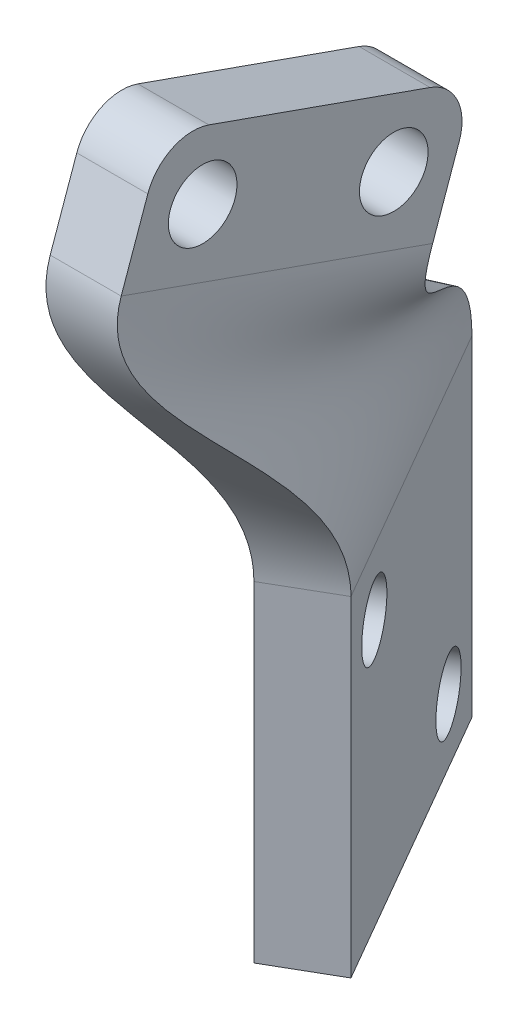
ISO-10303-21;
HEADER;
FILE_DESCRIPTION(('STEP AP214'),'2;1');
FILE_NAME('part.step','',(''),(''),'','','');
FILE_SCHEMA(('AUTOMOTIVE_DESIGN { 1 0 10303 214 1 1 1 1 }'));
ENDSEC;
DATA;
#1=APPLICATION_CONTEXT('core data for automotive mechanical design processes');
#2=APPLICATION_PROTOCOL_DEFINITION('international standard','automotive_design',2000,#1);
#3=PRODUCT_CONTEXT('',#1,'mechanical');
#4=PRODUCT('Part','Part','',(#3));
#5=PRODUCT_RELATED_PRODUCT_CATEGORY('part','',(#4));
#6=PRODUCT_DEFINITION_FORMATION('','',#4);
#7=PRODUCT_DEFINITION_CONTEXT('part definition',#1,'design');
#8=PRODUCT_DEFINITION('design','',#6,#7);
#9=PRODUCT_DEFINITION_SHAPE('','',#8);
#10=(LENGTH_UNIT() NAMED_UNIT(*) SI_UNIT(.MILLI.,.METRE.));
#11=(NAMED_UNIT(*) PLANE_ANGLE_UNIT() SI_UNIT($,.RADIAN.));
#12=(NAMED_UNIT(*) SI_UNIT($,.STERADIAN.) SOLID_ANGLE_UNIT());
#13=UNCERTAINTY_MEASURE_WITH_UNIT(LENGTH_MEASURE(1.E-05),#10,'distance_accuracy_value','');
#14=(GEOMETRIC_REPRESENTATION_CONTEXT(3) GLOBAL_UNCERTAINTY_ASSIGNED_CONTEXT((#13)) GLOBAL_UNIT_ASSIGNED_CONTEXT((#10,
#11,#12)) REPRESENTATION_CONTEXT('',''));
#15=CARTESIAN_POINT('',(0.,0.,0.));
#16=DIRECTION('',(0.,0.,1.));
#17=DIRECTION('',(1.,0.,0.));
#18=AXIS2_PLACEMENT_3D('',#15,#16,#17);
#19=CARTESIAN_POINT('',(36.0126016447818,0.,-20.7918852538335));
#20=DIRECTION('',(0.866025403784439,0.,-0.5));
#21=DIRECTION('',(-0.5,0.,-0.866025403784439));
#22=AXIS2_PLACEMENT_3D('',#19,#20,#21);
#23=PLANE('',#22);
#24=CARTESIAN_POINT('',(-20.7011353903661,15.4443912705977,-119.02295928581));
#25=DIRECTION('',(0.866025403784438,0.,-0.5));
#26=DIRECTION('',(-0.5,0.,-0.866025403784438));
#27=AXIS2_PLACEMENT_3D('',#24,#25,#26);
#28=CIRCLE('',#27,2.15000000000001);
#29=CARTESIAN_POINT('',(-21.7761353903661,15.4443912705977,-120.884913903947));
#30=VERTEX_POINT('',#29);
#31=EDGE_CURVE('E427',#30,#30,#28,.T.);
#32=ORIENTED_EDGE('',*,*,#31,.F.);
#33=EDGE_LOOP('',(#32));
#34=FACE_BOUND('',#33,.T.);
#35=DIRECTION('',(0.,-1.,0.));
#36=VECTOR('',#35,1.);
#37=CARTESIAN_POINT('',(-18.7011353903661,19.4443912705977,-115.558857670673));
#38=LINE('',#37,#36);
#39=CARTESIAN_POINT('',(-18.7011353903661,19.4443912705977,-115.558857670673));
#40=VERTEX_POINT('',#39);
#41=CARTESIAN_POINT('',(-18.7011353903661,-1.25560872940228,-115.558857670673));
#42=VERTEX_POINT('',#41);
#43=EDGE_CURVE('E421',#40,#42,#38,.T.);
#44=ORIENTED_EDGE('',*,*,#43,.T.);
#45=DIRECTION('',(-0.5,0.,-0.866025403784439));
#46=VECTOR('',#45,1.);
#47=CARTESIAN_POINT('',(-18.7011353903661,-1.25560872940228,-115.558857670673));
#48=LINE('',#47,#46);
#49=CARTESIAN_POINT('',(-29.0511353903661,-1.25560872940228,-133.485583529011));
#50=VERTEX_POINT('',#49);
#51=EDGE_CURVE('E430',#42,#50,#48,.T.);
#52=ORIENTED_EDGE('',*,*,#51,.T.);
#53=DIRECTION('',(0.,1.,0.));
#54=VECTOR('',#53,1.);
#55=CARTESIAN_POINT('',(-29.0511353903661,19.4443912705977,-133.485583529011));
#56=LINE('',#55,#54);
#57=CARTESIAN_POINT('',(-29.0511353903661,19.4443912705977,-133.485583529011));
#58=VERTEX_POINT('',#57);
#59=EDGE_CURVE('E414',#50,#58,#56,.T.);
#60=ORIENTED_EDGE('',*,*,#59,.T.);
#61=DIRECTION('',(-0.5,0.,-0.866025403784439));
#62=VECTOR('',#61,1.);
#63=CARTESIAN_POINT('',(36.0126016447818,19.4443912705977,-20.7918852538335));
#64=LINE('',#63,#62);
#65=EDGE_CURVE('E412',#58,#40,#64,.F.);
#66=ORIENTED_EDGE('',*,*,#65,.T.);
#67=EDGE_LOOP('',(#44,#52,#60,#66));
#68=FACE_BOUND('',#67,.T.);
#69=CARTESIAN_POINT('',(-27.0511353903661,2.74439127059772,-130.021481913873));
#70=DIRECTION('',(0.866025403784438,0.,-0.5));
#71=DIRECTION('',(-0.5,0.,-0.866025403784438));
#72=AXIS2_PLACEMENT_3D('',#69,#70,#71);
#73=CIRCLE('',#72,2.15000000000001);
#74=CARTESIAN_POINT('',(-28.1261353903661,2.74439127059772,-131.883436532009));
#75=VERTEX_POINT('',#74);
#76=EDGE_CURVE('E445',#75,#75,#73,.T.);
#77=ORIENTED_EDGE('',*,*,#76,.F.);
#78=EDGE_LOOP('',(#77));
#79=FACE_BOUND('',#78,.T.);
#80=ADVANCED_FACE('F279',(#34,#68,#79),#23,.T.);
#81=CARTESIAN_POINT('',(32.158788597941,0.,-18.5668852538335));
#82=DIRECTION('',(0.866025403784439,0.,-0.5));
#83=DIRECTION('',(-0.5,0.,-0.866025403784439));
#84=AXIS2_PLACEMENT_3D('',#81,#82,#83);
#85=PLANE('',#84);
#86=DIRECTION('',(0.,-1.,0.));
#87=VECTOR('',#86,1.);
#88=CARTESIAN_POINT('',(-22.5549484372068,19.4443912705977,-113.333857670673));
#89=LINE('',#88,#87);
#90=CARTESIAN_POINT('',(-22.5549484372068,19.4443912705977,-113.333857670673));
#91=VERTEX_POINT('',#90);
#92=CARTESIAN_POINT('',(-22.5549484372068,-1.25560872940228,-113.333857670673));
#93=VERTEX_POINT('',#92);
#94=EDGE_CURVE('E423',#91,#93,#89,.T.);
#95=ORIENTED_EDGE('',*,*,#94,.F.);
#96=DIRECTION('',(-0.5,0.,-0.866025403784439));
#97=VECTOR('',#96,1.);
#98=CARTESIAN_POINT('',(32.1587885979411,19.4443912705977,-18.5668852538335));
#99=LINE('',#98,#97);
#100=CARTESIAN_POINT('',(-32.9049484372068,19.4443912705977,-131.260583529011));
#101=VERTEX_POINT('',#100);
#102=EDGE_CURVE('E418',#101,#91,#99,.F.);
#103=ORIENTED_EDGE('',*,*,#102,.F.);
#104=DIRECTION('',(0.,1.,0.));
#105=VECTOR('',#104,1.);
#106=CARTESIAN_POINT('',(-32.9049484372068,19.4443912705977,-131.260583529011));
#107=LINE('',#106,#105);
#108=CARTESIAN_POINT('',(-32.9049484372068,-1.25560872940228,-131.260583529011));
#109=VERTEX_POINT('',#108);
#110=EDGE_CURVE('E422',#109,#101,#107,.T.);
#111=ORIENTED_EDGE('',*,*,#110,.F.);
#112=DIRECTION('',(-0.5,0.,-0.866025403784439));
#113=VECTOR('',#112,1.);
#114=CARTESIAN_POINT('',(-22.5549484372068,-1.25560872940228,-113.333857670673));
#115=LINE('',#114,#113);
#116=EDGE_CURVE('E426',#93,#109,#115,.T.);
#117=ORIENTED_EDGE('',*,*,#116,.F.);
#118=EDGE_LOOP('',(#95,#103,#111,#117));
#119=FACE_BOUND('',#118,.T.);
#120=CARTESIAN_POINT('',(-24.5549484372068,15.4443912705977,-116.79795928581));
#121=DIRECTION('',(0.866025403784438,0.,-0.5));
#122=DIRECTION('',(-0.5,0.,-0.866025403784438));
#123=AXIS2_PLACEMENT_3D('',#120,#121,#122);
#124=CIRCLE('',#123,2.15000000000001);
#125=CARTESIAN_POINT('',(-25.6299484372068,15.4443912705977,-118.659913903947));
#126=VERTEX_POINT('',#125);
#127=EDGE_CURVE('E442',#126,#126,#124,.T.);
#128=ORIENTED_EDGE('',*,*,#127,.T.);
#129=EDGE_LOOP('',(#128));
#130=FACE_BOUND('',#129,.T.);
#131=CARTESIAN_POINT('',(-30.9049484372068,2.74439127059772,-127.796481913873));
#132=DIRECTION('',(0.866025403784438,0.,-0.5));
#133=DIRECTION('',(-0.5,0.,-0.866025403784438));
#134=AXIS2_PLACEMENT_3D('',#131,#132,#133);
#135=CIRCLE('',#134,2.15000000000001);
#136=CARTESIAN_POINT('',(-31.9799484372068,2.74439127059772,-129.658436532009));
#137=VERTEX_POINT('',#136);
#138=EDGE_CURVE('E448',#137,#137,#135,.T.);
#139=ORIENTED_EDGE('',*,*,#138,.T.);
#140=EDGE_LOOP('',(#139));
#141=FACE_BOUND('',#140,.T.);
#142=ADVANCED_FACE('F583',(#119,#130,#141),#85,.F.);
#143=CARTESIAN_POINT('',(-18.7011353903661,19.4443912705977,-115.558857670673));
#144=DIRECTION('',(-0.500000000000001,0.,-0.866025403784438));
#145=DIRECTION('',(-0.866025403784438,0.,0.500000000000001));
#146=AXIS2_PLACEMENT_3D('',#143,#144,#145);
#147=PLANE('',#146);
#148=ORIENTED_EDGE('',*,*,#94,.T.);
#149=DIRECTION('',(-0.866025403784438,0.,0.500000000000001));
#150=VECTOR('',#149,1.);
#151=CARTESIAN_POINT('',(-18.7011353903661,-1.25560872940228,-115.558857670673));
#152=LINE('',#151,#150);
#153=EDGE_CURVE('E434',#42,#93,#152,.T.);
#154=ORIENTED_EDGE('',*,*,#153,.F.);
#155=ORIENTED_EDGE('',*,*,#43,.F.);
#156=DIRECTION('',(-0.866025403784438,0.,0.500000000000001));
#157=VECTOR('',#156,1.);
#158=CARTESIAN_POINT('',(-18.7011353903661,19.4443912705977,-115.558857670673));
#159=LINE('',#158,#157);
#160=EDGE_CURVE('E367',#40,#91,#159,.T.);
#161=ORIENTED_EDGE('',*,*,#160,.T.);
#162=EDGE_LOOP('',(#148,#154,#155,#161));
#163=FACE_BOUND('',#162,.T.);
#164=ADVANCED_FACE('F635',(#163),#147,.F.);
#165=CARTESIAN_POINT('',(-18.7011353903661,-1.25560872940228,-115.558857670673));
#166=DIRECTION('',(0.,1.,0.));
#167=DIRECTION('',(-1.,0.,0.));
#168=AXIS2_PLACEMENT_3D('',#165,#166,#167);
#169=PLANE('',#168);
#170=ORIENTED_EDGE('',*,*,#116,.T.);
#171=DIRECTION('',(-0.866025403784438,0.,0.500000000000001));
#172=VECTOR('',#171,1.);
#173=CARTESIAN_POINT('',(-29.0511353903661,-1.25560872940228,-133.485583529011));
#174=LINE('',#173,#172);
#175=EDGE_CURVE('E417',#50,#109,#174,.T.);
#176=ORIENTED_EDGE('',*,*,#175,.F.);
#177=ORIENTED_EDGE('',*,*,#51,.F.);
#178=ORIENTED_EDGE('',*,*,#153,.T.);
#179=EDGE_LOOP('',(#170,#176,#177,#178));
#180=FACE_BOUND('',#179,.T.);
#181=ADVANCED_FACE('F644',(#180),#169,.F.);
#182=CARTESIAN_POINT('',(-29.0511353903661,19.4443912705977,-133.485583529011));
#183=DIRECTION('',(0.500000000000001,0.,0.866025403784438));
#184=DIRECTION('',(0.866025403784438,0.,-0.500000000000001));
#185=AXIS2_PLACEMENT_3D('',#182,#183,#184);
#186=PLANE('',#185);
#187=ORIENTED_EDGE('',*,*,#110,.T.);
#188=DIRECTION('',(0.866025403784438,0.,-0.500000000000001));
#189=VECTOR('',#188,1.);
#190=CARTESIAN_POINT('',(-29.0511353903661,19.4443912705977,-133.485583529011));
#191=LINE('',#190,#189);
#192=EDGE_CURVE('E411',#58,#101,#191,.F.);
#193=ORIENTED_EDGE('',*,*,#192,.F.);
#194=ORIENTED_EDGE('',*,*,#59,.F.);
#195=ORIENTED_EDGE('',*,*,#175,.T.);
#196=EDGE_LOOP('',(#187,#193,#194,#195));
#197=FACE_BOUND('',#196,.T.);
#198=ADVANCED_FACE('F579',(#197),#186,.F.);
#199=CARTESIAN_POINT('',(-20.7011353903661,15.4443912705977,-119.02295928581));
#200=DIRECTION('',(-0.866025403784438,0.,0.500000000000001));
#201=DIRECTION('',(0.500000000000001,0.,0.866025403784438));
#202=AXIS2_PLACEMENT_3D('',#199,#200,#201);
#203=CYLINDRICAL_SURFACE('',#202,2.15000000000001);
#204=ORIENTED_EDGE('',*,*,#31,.T.);
#205=EDGE_LOOP('',(#204));
#206=FACE_BOUND('',#205,.T.);
#207=ORIENTED_EDGE('',*,*,#127,.F.);
#208=EDGE_LOOP('',(#207));
#209=FACE_BOUND('',#208,.T.);
#210=ADVANCED_FACE('F575',(#206,#209),#203,.F.);
#211=CARTESIAN_POINT('',(-27.0511353903661,2.74439127059772,-130.021481913873));
#212=DIRECTION('',(-0.866025403784438,0.,0.500000000000001));
#213=DIRECTION('',(0.500000000000001,0.,0.866025403784438));
#214=AXIS2_PLACEMENT_3D('',#211,#212,#213);
#215=CYLINDRICAL_SURFACE('',#214,2.15000000000001);
#216=ORIENTED_EDGE('',*,*,#76,.T.);
#217=EDGE_LOOP('',(#216));
#218=FACE_BOUND('',#217,.T.);
#219=ORIENTED_EDGE('',*,*,#138,.F.);
#220=EDGE_LOOP('',(#219));
#221=FACE_BOUND('',#220,.T.);
#222=ADVANCED_FACE('F567',(#218,#221),#215,.F.);
#223=CARTESIAN_POINT('',(-19.9264999621046,34.817114234562,-121.906255403122));
#224=CARTESIAN_POINT('',(-19.9264999621046,29.4641305199487,-120.013689861029));
#225=CARTESIAN_POINT('',(-29.0511353903661,25.7539488037761,-133.485583529011));
#226=CARTESIAN_POINT('',(-29.0511353903661,19.4443912705977,-133.485583529011));
#227=CARTESIAN_POINT('',(-19.9264999621046,35.967114234562,-118.653564209663));
#228=CARTESIAN_POINT('',(-19.9264999621046,30.4132485934664,-116.689976181355));
#229=CARTESIAN_POINT('',(-27.3261353903661,25.987559033846,-130.497795885954));
#230=CARTESIAN_POINT('',(-27.3261353903661,19.4443912705977,-130.497795885954));
#231=CARTESIAN_POINT('',(-19.9264999621046,38.267114234562,-112.148181822747));
#232=CARTESIAN_POINT('',(-19.9264999621046,32.311484740502,-110.042548822005));
#233=CARTESIAN_POINT('',(-23.8761353903661,26.4547794939856,-124.522220599842));
#234=CARTESIAN_POINT('',(-23.8761353903661,19.4443912705977,-124.522220599842));
#235=CARTESIAN_POINT('',(-19.9264999621046,40.567114234562,-105.642799435831));
#236=CARTESIAN_POINT('',(-19.9264999621046,33.9336796904833,-103.297526161493));
#237=CARTESIAN_POINT('',(-20.4261353903661,27.2147858576111,-118.546645313729));
#238=CARTESIAN_POINT('',(-20.4261353903661,19.4443912705977,-118.546645313729));
#239=CARTESIAN_POINT('',(-19.9264999621046,41.717114234562,-102.390108242373));
#240=CARTESIAN_POINT('',(-19.9264999621046,34.744777165474,-99.9250148312376));
#241=CARTESIAN_POINT('',(-18.7011353903661,27.5947890394238,-115.558857670673));
#242=CARTESIAN_POINT('',(-18.7011353903661,19.4443912705977,-115.558857670673));
#243=B_SPLINE_SURFACE_WITH_KNOTS('',3,3,((#223,#224,#225,#226),(#227,#228,#229,#230),(#231,#232,
#233,#234),(#235,#236,#237,#238),(#239,#240,#241,#242)),.UNSPECIFIED.,.F.,.F.,.F.,(4,1,4),(4,4),
(0.,0.5,1.),(0.,1.),.UNSPECIFIED.);
#244=DIRECTION('',(0.,0.333333333333334,0.942809041582063));
#245=VECTOR('',#244,1.);
#246=CARTESIAN_POINT('',(-19.9264999621046,41.717114234562,-102.390108242373));
#247=LINE('',#246,#245);
#248=CARTESIAN_POINT('',(-19.9264999621046,34.817114234562,-121.906255403122));
#249=VERTEX_POINT('',#248);
#250=CARTESIAN_POINT('',(-19.9264999621046,41.717114234562,-102.390108242373));
#251=VERTEX_POINT('',#250);
#252=EDGE_CURVE('E375',#249,#251,#247,.T.);
#253=CARTESIAN_POINT('',(-19.9264999621046,41.717114234562,-102.390108242373));
#254=CARTESIAN_POINT('',(-19.9264999621046,34.744777165474,-99.9250148312376));
#255=CARTESIAN_POINT('',(-18.7011353903661,27.5947890394238,-115.558857670673));
#256=CARTESIAN_POINT('',(-18.7011353903661,19.4443912705977,-115.558857670673));
#257=B_SPLINE_CURVE_WITH_KNOTS('',3,(#253,#254,#255,#256),.UNSPECIFIED.,.F.,.F.,(4,4),(0.,1.),.UNSPECIFIED.);
#258=EDGE_CURVE('E359',#251,#40,#257,.T.);
#259=CARTESIAN_POINT('',(-19.9264999621046,34.817114234562,-121.906255403122));
#260=CARTESIAN_POINT('',(-19.9264999621046,29.4641305199487,-120.013689861029));
#261=CARTESIAN_POINT('',(-29.0511353903661,25.7539488037761,-133.485583529011));
#262=CARTESIAN_POINT('',(-29.0511353903661,19.4443912705977,-133.485583529011));
#263=B_SPLINE_CURVE_WITH_KNOTS('',3,(#259,#260,#261,#262),.UNSPECIFIED.,.F.,.F.,(4,4),(0.,1.),.UNSPECIFIED.);
#264=EDGE_CURVE('E371',#58,#249,#263,.F.);
#265=ORIENTED_EDGE('',*,*,#252,.T.);
#266=ORIENTED_EDGE('',*,*,#258,.T.);
#267=ORIENTED_EDGE('',*,*,#65,.F.);
#268=ORIENTED_EDGE('',*,*,#264,.T.);
#269=EDGE_LOOP('',(#265,#266,#267,#268));
#270=FACE_BOUND('',#269,.T.);
#271=ADVANCED_FACE('F377',(#270),#243,.T.);
#272=CARTESIAN_POINT('',(-19.9264999621046,41.717114234562,-102.390108242373));
#273=CARTESIAN_POINT('',(-19.9264999621046,34.744777165474,-99.9250148312376));
#274=CARTESIAN_POINT('',(-18.7011353903661,27.5947890394238,-115.558857670673));
#275=CARTESIAN_POINT('',(-18.7011353903661,19.4443912705977,-115.558857670673));
#276=CARTESIAN_POINT('',(-20.6681666287712,41.717114234562,-102.390108242373));
#277=CARTESIAN_POINT('',(-20.6681666287712,34.7632933196294,-99.93156128032));
#278=CARTESIAN_POINT('',(-19.3434375648395,27.5586682106952,-115.188024337339));
#279=CARTESIAN_POINT('',(-19.3434375648395,19.4443912705977,-115.188024337339));
#280=CARTESIAN_POINT('',(-22.1514999621046,41.717114234562,-102.390108242373));
#281=CARTESIAN_POINT('',(-22.1514999621046,34.8003256279401,-99.9446541784847));
#282=CARTESIAN_POINT('',(-20.6280419137864,27.486426553238,-114.446357670673));
#283=CARTESIAN_POINT('',(-20.6280419137865,19.4443912705977,-114.446357670673));
#284=CARTESIAN_POINT('',(-23.6348332954379,41.717114234562,-102.390108242373));
#285=CARTESIAN_POINT('',(-23.6348332954379,34.8294381564157,-99.954947011636));
#286=CARTESIAN_POINT('',(-21.9126462627334,27.4225850908212,-113.704691004006));
#287=CARTESIAN_POINT('',(-21.9126462627334,19.4443912705977,-113.704691004006));
#288=CARTESIAN_POINT('',(-24.3764999621046,41.717114234562,-102.390108242373));
#289=CARTESIAN_POINT('',(-24.3764999621046,34.8439944206534,-99.9600934282116));
#290=CARTESIAN_POINT('',(-22.5549484372068,27.3906643596128,-113.333857670673));
#291=CARTESIAN_POINT('',(-22.5549484372068,19.4443912705977,-113.333857670673));
#292=B_SPLINE_SURFACE_WITH_KNOTS('',3,3,((#272,#273,#274,#275),(#276,#277,#278,#279),(#280,#281,
#282,#283),(#284,#285,#286,#287),(#288,#289,#290,#291)),.UNSPECIFIED.,.F.,.F.,.F.,(4,1,4),(4,4),
(0.,0.5,1.),(0.,1.),.UNSPECIFIED.);
#293=DIRECTION('',(1.,0.,0.));
#294=VECTOR('',#293,1.);
#295=CARTESIAN_POINT('',(-24.3764999621046,41.717114234562,-102.390108242373));
#296=LINE('',#295,#294);
#297=CARTESIAN_POINT('',(-24.3764999621046,41.717114234562,-102.390108242373));
#298=VERTEX_POINT('',#297);
#299=EDGE_CURVE('E364',#298,#251,#296,.T.);
#300=CARTESIAN_POINT('',(-24.3764999621046,41.717114234562,-102.390108242373));
#301=CARTESIAN_POINT('',(-24.3764999621046,34.8439944206534,-99.9600934282116));
#302=CARTESIAN_POINT('',(-22.5549484372068,27.3906643596128,-113.333857670673));
#303=CARTESIAN_POINT('',(-22.5549484372068,19.4443912705977,-113.333857670673));
#304=B_SPLINE_CURVE_WITH_KNOTS('',3,(#300,#301,#302,#303),.UNSPECIFIED.,.F.,.F.,(4,4),(0.,1.),.UNSPECIFIED.);
#305=EDGE_CURVE('E370',#298,#91,#304,.T.);
#306=ORIENTED_EDGE('',*,*,#299,.F.);
#307=ORIENTED_EDGE('',*,*,#305,.T.);
#308=ORIENTED_EDGE('',*,*,#160,.F.);
#309=ORIENTED_EDGE('',*,*,#258,.F.);
#310=EDGE_LOOP('',(#306,#307,#308,#309));
#311=FACE_BOUND('',#310,.T.);
#312=ADVANCED_FACE('F361',(#311),#292,.T.);
#313=CARTESIAN_POINT('',(-24.3764999621046,34.817114234562,-121.906255403122));
#314=CARTESIAN_POINT('',(-24.3764999621046,29.6321550476523,-120.073095502502));
#315=CARTESIAN_POINT('',(-32.9049484372068,25.4768429904699,-131.260583529011));
#316=CARTESIAN_POINT('',(-32.9049484372068,19.4443912705977,-131.260583529011));
#317=CARTESIAN_POINT('',(-23.6348332954379,34.817114234562,-121.906255403122));
#318=CARTESIAN_POINT('',(-23.6348332954379,29.606088630895,-120.063879632477));
#319=CARTESIAN_POINT('',(-32.2626462627334,25.5209720820269,-131.631416862344));
#320=CARTESIAN_POINT('',(-32.2626462627334,19.4443912705977,-131.631416862344));
#321=CARTESIAN_POINT('',(-22.1514999621046,34.817114234562,-121.906255403122));
#322=CARTESIAN_POINT('',(-22.1514999621046,29.5539557973803,-120.045447892426));
#323=CARTESIAN_POINT('',(-30.9780419137865,25.6092302651409,-132.373083529011));
#324=CARTESIAN_POINT('',(-30.9780419137865,19.4443912705977,-132.373083529011));
#325=CARTESIAN_POINT('',(-20.6681666287713,34.817114234562,-121.906255403122));
#326=CARTESIAN_POINT('',(-20.6681666287713,29.4940722790926,-120.024275871495));
#327=CARTESIAN_POINT('',(-29.6934375648396,25.7057092908977,-133.114750195677));
#328=CARTESIAN_POINT('',(-29.6934375648396,19.4443912705977,-133.114750195677));
#329=CARTESIAN_POINT('',(-19.9264999621046,34.817114234562,-121.906255403122));
#330=CARTESIAN_POINT('',(-19.9264999621046,29.4641305199487,-120.013689861029));
#331=CARTESIAN_POINT('',(-29.0511353903661,25.7539488037761,-133.485583529011));
#332=CARTESIAN_POINT('',(-29.0511353903661,19.4443912705977,-133.485583529011));
#333=B_SPLINE_SURFACE_WITH_KNOTS('',3,3,((#313,#314,#315,#316),(#317,#318,#319,#320),(#321,#322,
#323,#324),(#325,#326,#327,#328),(#329,#330,#331,#332)),.UNSPECIFIED.,.F.,.F.,.F.,(4,1,4),(4,4),
(0.,0.5,1.),(0.,1.),.UNSPECIFIED.);
#334=DIRECTION('',(1.,0.,0.));
#335=VECTOR('',#334,1.);
#336=CARTESIAN_POINT('',(-24.3764999621046,34.817114234562,-121.906255403122));
#337=LINE('',#336,#335);
#338=CARTESIAN_POINT('',(-24.3764999621046,34.817114234562,-121.906255403122));
#339=VERTEX_POINT('',#338);
#340=EDGE_CURVE('E512',#339,#249,#337,.T.);
#341=CARTESIAN_POINT('',(-24.3764999621046,34.817114234562,-121.906255403122));
#342=CARTESIAN_POINT('',(-24.3764999621046,29.6321550476523,-120.073095502502));
#343=CARTESIAN_POINT('',(-32.9049484372068,25.4768429904699,-131.260583529011));
#344=CARTESIAN_POINT('',(-32.9049484372068,19.4443912705977,-131.260583529011));
#345=B_SPLINE_CURVE_WITH_KNOTS('',3,(#341,#342,#343,#344),.UNSPECIFIED.,.F.,.F.,(4,4),(0.,1.),.UNSPECIFIED.);
#346=EDGE_CURVE('E451',#339,#101,#345,.T.);
#347=ORIENTED_EDGE('',*,*,#340,.T.);
#348=ORIENTED_EDGE('',*,*,#264,.F.);
#349=ORIENTED_EDGE('',*,*,#192,.T.);
#350=ORIENTED_EDGE('',*,*,#346,.F.);
#351=EDGE_LOOP('',(#347,#348,#349,#350));
#352=FACE_BOUND('',#351,.T.);
#353=ADVANCED_FACE('F533',(#352),#333,.T.);
#354=CARTESIAN_POINT('',(-24.3764999621046,41.717114234562,-102.390108242373));
#355=CARTESIAN_POINT('',(-24.3764999621046,34.8439944206534,-99.9600934282116));
#356=CARTESIAN_POINT('',(-22.5549484372068,27.3906643596128,-113.333857670673));
#357=CARTESIAN_POINT('',(-22.5549484372068,19.4443912705977,-113.333857670673));
#358=CARTESIAN_POINT('',(-24.3764999621046,40.567114234562,-105.642799435831));
#359=CARTESIAN_POINT('',(-24.3764999621046,34.0462975382929,-103.337342583428));
#360=CARTESIAN_POINT('',(-24.2799484372068,26.996447702919,-116.321645313729));
#361=CARTESIAN_POINT('',(-24.2799484372068,19.4443912705977,-116.321645313729));
#362=CARTESIAN_POINT('',(-24.3764999621046,38.267114234562,-112.148181822747));
#363=CARTESIAN_POINT('',(-24.3764999621046,32.4509037735719,-110.09184089386));
#364=CARTESIAN_POINT('',(-27.7299484372068,26.2080143895314,-122.297220599842));
#365=CARTESIAN_POINT('',(-27.7299484372068,19.4443912705977,-122.297220599842));
#366=CARTESIAN_POINT('',(-24.3764999621046,35.967114234562,-118.653564209663));
#367=CARTESIAN_POINT('',(-24.3764999621046,30.5717379562922,-116.746010632955));
#368=CARTESIAN_POINT('',(-31.1799484372068,25.7205667901571,-128.272795885954));
#369=CARTESIAN_POINT('',(-31.1799484372068,19.4443912705977,-128.272795885954));
#370=CARTESIAN_POINT('',(-24.3764999621046,34.817114234562,-121.906255403122));
#371=CARTESIAN_POINT('',(-24.3764999621046,29.6321550476523,-120.073095502502));
#372=CARTESIAN_POINT('',(-32.9049484372068,25.4768429904699,-131.260583529011));
#373=CARTESIAN_POINT('',(-32.9049484372068,19.4443912705977,-131.260583529011));
#374=B_SPLINE_SURFACE_WITH_KNOTS('',3,3,((#354,#355,#356,#357),(#358,#359,#360,#361),(#362,#363,
#364,#365),(#366,#367,#368,#369),(#370,#371,#372,#373)),.UNSPECIFIED.,.F.,.F.,.F.,(4,1,4),(4,4),
(0.,0.5,1.),(0.,1.),.UNSPECIFIED.);
#375=DIRECTION('',(0.,0.333333333333334,0.942809041582063));
#376=VECTOR('',#375,1.);
#377=CARTESIAN_POINT('',(-24.3764999621046,41.717114234562,-102.390108242373));
#378=LINE('',#377,#376);
#379=EDGE_CURVE('E392',#339,#298,#378,.T.);
#380=ORIENTED_EDGE('',*,*,#379,.F.);
#381=ORIENTED_EDGE('',*,*,#346,.T.);
#382=ORIENTED_EDGE('',*,*,#102,.T.);
#383=ORIENTED_EDGE('',*,*,#305,.F.);
#384=EDGE_LOOP('',(#380,#381,#382,#383));
#385=FACE_BOUND('',#384,.T.);
#386=ADVANCED_FACE('F483',(#385),#374,.T.);
#387=CARTESIAN_POINT('',(-24.3764999621045,0.,0.));
#388=DIRECTION('',(1.,0.,0.));
#389=DIRECTION('',(0.,0.,-1.));
#390=AXIS2_PLACEMENT_3D('',#387,#388,#389);
#391=PLANE('',#390);
#392=DIRECTION('',(0.,0.942809041582063,-0.333333333333335));
#393=VECTOR('',#392,1.);
#394=CARTESIAN_POINT('',(-24.3764999621046,49.2595865672185,-105.05677490904));
#395=LINE('',#394,#393);
#396=CARTESIAN_POINT('',(-24.3764999621046,46.4311594424723,-104.05677490904));
#397=VERTEX_POINT('',#396);
#398=EDGE_CURVE('E391',#298,#397,#395,.T.);
#399=ORIENTED_EDGE('',*,*,#398,.T.);
#400=CARTESIAN_POINT('',(-24.3764999621046,45.4311594424723,-106.885202033786));
#401=DIRECTION('',(1.,0.,0.));
#402=DIRECTION('',(0.,0.,-1.));
#403=AXIS2_PLACEMENT_3D('',#400,#401,#402);
#404=CIRCLE('',#403,3.);
#405=CARTESIAN_POINT('',(-24.3764999621046,48.2595865672185,-107.885202033786));
#406=VERTEX_POINT('',#405);
#407=EDGE_CURVE('E287',#397,#406,#404,.F.);
#408=ORIENTED_EDGE('',*,*,#407,.T.);
#409=DIRECTION('',(0.,-0.333333333333334,-0.942809041582063));
#410=VECTOR('',#409,1.);
#411=CARTESIAN_POINT('',(-24.3764999621046,42.3595865672185,-124.572922069788));
#412=LINE('',#411,#410);
#413=CARTESIAN_POINT('',(-24.3764999621046,43.3595865672185,-121.744494945042));
#414=VERTEX_POINT('',#413);
#415=EDGE_CURVE('E384',#406,#414,#412,.T.);
#416=ORIENTED_EDGE('',*,*,#415,.T.);
#417=CARTESIAN_POINT('',(-24.3764999621046,40.5311594424723,-120.744494945042));
#418=DIRECTION('',(1.,0.,0.));
#419=DIRECTION('',(0.,0.,-1.));
#420=AXIS2_PLACEMENT_3D('',#417,#418,#419);
#421=CIRCLE('',#420,3.);
#422=CARTESIAN_POINT('',(-24.3764999621046,39.5311594424723,-123.572922069788));
#423=VERTEX_POINT('',#422);
#424=EDGE_CURVE('E294',#414,#423,#421,.F.);
#425=ORIENTED_EDGE('',*,*,#424,.T.);
#426=DIRECTION('',(0.,-0.942809041582063,0.333333333333334));
#427=VECTOR('',#426,1.);
#428=CARTESIAN_POINT('',(-24.3764999621046,34.817114234562,-121.906255403122));
#429=LINE('',#428,#427);
#430=EDGE_CURVE('E404',#423,#339,#429,.T.);
#431=ORIENTED_EDGE('',*,*,#430,.T.);
#432=ORIENTED_EDGE('',*,*,#379,.T.);
#433=EDGE_LOOP('',(#399,#408,#416,#425,#431,#432));
#434=FACE_BOUND('',#433,.T.);
#435=CARTESIAN_POINT('',(-24.3764999621046,44.1550170675569,-107.494677742034));
#436=DIRECTION('',(-1.,0.,0.));
#437=DIRECTION('',(0.,0.,1.));
#438=AXIS2_PLACEMENT_3D('',#435,#436,#437);
#439=CIRCLE('',#438,2.15);
#440=CARTESIAN_POINT('',(-24.3764999621046,44.1550170675569,-105.344677742034));
#441=VERTEX_POINT('',#440);
#442=EDGE_CURVE('E406',#441,#441,#439,.T.);
#443=ORIENTED_EDGE('',*,*,#442,.F.);
#444=EDGE_LOOP('',(#443));
#445=FACE_BOUND('',#444,.T.);
#446=CARTESIAN_POINT('',(-24.3764999621046,39.9216837342236,-119.468352570127));
#447=DIRECTION('',(-1.,0.,0.));
#448=DIRECTION('',(0.,0.,1.));
#449=AXIS2_PLACEMENT_3D('',#446,#447,#448);
#450=CIRCLE('',#449,2.15);
#451=CARTESIAN_POINT('',(-24.3764999621046,39.9216837342236,-117.318352570127));
#452=VERTEX_POINT('',#451);
#453=EDGE_CURVE('E849',#452,#452,#450,.T.);
#454=ORIENTED_EDGE('',*,*,#453,.F.);
#455=EDGE_LOOP('',(#454));
#456=FACE_BOUND('',#455,.T.);
#457=ADVANCED_FACE('F473',(#434,#445,#456),#391,.F.);
#458=CARTESIAN_POINT('',(-19.9264999621045,0.,0.));
#459=DIRECTION('',(1.,0.,0.));
#460=DIRECTION('',(0.,0.,-1.));
#461=AXIS2_PLACEMENT_3D('',#458,#459,#460);
#462=PLANE('',#461);
#463=CARTESIAN_POINT('',(-19.9264999621046,44.1550170675569,-107.494677742034));
#464=DIRECTION('',(-1.,0.,0.));
#465=DIRECTION('',(0.,0.,1.));
#466=AXIS2_PLACEMENT_3D('',#463,#464,#465);
#467=CIRCLE('',#466,2.15);
#468=CARTESIAN_POINT('',(-19.9264999621046,44.1550170675569,-105.344677742034));
#469=VERTEX_POINT('',#468);
#470=EDGE_CURVE('E851',#469,#469,#467,.T.);
#471=ORIENTED_EDGE('',*,*,#470,.T.);
#472=EDGE_LOOP('',(#471));
#473=FACE_BOUND('',#472,.T.);
#474=DIRECTION('',(0.,-0.333333333333334,-0.942809041582063));
#475=VECTOR('',#474,1.);
#476=CARTESIAN_POINT('',(-19.9264999621046,42.3595865672185,-124.572922069788));
#477=LINE('',#476,#475);
#478=CARTESIAN_POINT('',(-19.9264999621046,48.2595865672185,-107.885202033786));
#479=VERTEX_POINT('',#478);
#480=CARTESIAN_POINT('',(-19.9264999621046,43.3595865672185,-121.744494945042));
#481=VERTEX_POINT('',#480);
#482=EDGE_CURVE('E400',#479,#481,#477,.T.);
#483=ORIENTED_EDGE('',*,*,#482,.F.);
#484=CARTESIAN_POINT('',(-19.9264999621046,45.4311594424723,-106.885202033786));
#485=DIRECTION('',(1.,0.,0.));
#486=DIRECTION('',(0.,0.,-1.));
#487=AXIS2_PLACEMENT_3D('',#484,#485,#486);
#488=CIRCLE('',#487,3.);
#489=CARTESIAN_POINT('',(-19.9264999621046,46.4311594424723,-104.05677490904));
#490=VERTEX_POINT('',#489);
#491=EDGE_CURVE('E399',#479,#490,#488,.T.);
#492=ORIENTED_EDGE('',*,*,#491,.T.);
#493=DIRECTION('',(0.,0.942809041582063,-0.333333333333335));
#494=VECTOR('',#493,1.);
#495=CARTESIAN_POINT('',(-19.9264999621046,49.2595865672185,-105.05677490904));
#496=LINE('',#495,#494);
#497=EDGE_CURVE('E390',#251,#490,#496,.T.);
#498=ORIENTED_EDGE('',*,*,#497,.F.);
#499=ORIENTED_EDGE('',*,*,#252,.F.);
#500=DIRECTION('',(0.,-0.942809041582063,0.333333333333334));
#501=VECTOR('',#500,1.);
#502=CARTESIAN_POINT('',(-19.9264999621046,34.817114234562,-121.906255403122));
#503=LINE('',#502,#501);
#504=CARTESIAN_POINT('',(-19.9264999621046,39.5311594424723,-123.572922069788));
#505=VERTEX_POINT('',#504);
#506=EDGE_CURVE('E401',#505,#249,#503,.T.);
#507=ORIENTED_EDGE('',*,*,#506,.F.);
#508=CARTESIAN_POINT('',(-19.9264999621046,40.5311594424723,-120.744494945042));
#509=DIRECTION('',(1.,0.,0.));
#510=DIRECTION('',(0.,0.,-1.));
#511=AXIS2_PLACEMENT_3D('',#508,#509,#510);
#512=CIRCLE('',#511,3.);
#513=EDGE_CURVE('E521',#505,#481,#512,.T.);
#514=ORIENTED_EDGE('',*,*,#513,.T.);
#515=EDGE_LOOP('',(#483,#492,#498,#499,#507,#514));
#516=FACE_BOUND('',#515,.T.);
#517=CARTESIAN_POINT('',(-19.9264999621046,39.9216837342236,-119.468352570127));
#518=DIRECTION('',(-1.,0.,0.));
#519=DIRECTION('',(0.,0.,1.));
#520=AXIS2_PLACEMENT_3D('',#517,#518,#519);
#521=CIRCLE('',#520,2.15);
#522=CARTESIAN_POINT('',(-19.9264999621046,39.9216837342236,-117.318352570127));
#523=VERTEX_POINT('',#522);
#524=EDGE_CURVE('E852',#523,#523,#521,.T.);
#525=ORIENTED_EDGE('',*,*,#524,.T.);
#526=EDGE_LOOP('',(#525));
#527=FACE_BOUND('',#526,.T.);
#528=ADVANCED_FACE('F397',(#473,#516,#527),#462,.T.);
#529=CARTESIAN_POINT('',(-24.3764999621046,34.817114234562,-121.906255403122));
#530=DIRECTION('',(0.,0.333333333333334,0.942809041582063));
#531=DIRECTION('',(0.,-0.942809041582063,0.333333333333334));
#532=AXIS2_PLACEMENT_3D('',#529,#530,#531);
#533=PLANE('',#532);
#534=ORIENTED_EDGE('',*,*,#430,.F.);
#535=DIRECTION('',(1.,0.,0.));
#536=VECTOR('',#535,1.);
#537=CARTESIAN_POINT('',(-24.3764999621046,39.5311594424723,-123.572922069788));
#538=LINE('',#537,#536);
#539=EDGE_CURVE('E13',#423,#505,#538,.T.);
#540=ORIENTED_EDGE('',*,*,#539,.T.);
#541=ORIENTED_EDGE('',*,*,#506,.T.);
#542=ORIENTED_EDGE('',*,*,#340,.F.);
#543=EDGE_LOOP('',(#534,#540,#541,#542));
#544=FACE_BOUND('',#543,.T.);
#545=ADVANCED_FACE('F489',(#544),#533,.F.);
#546=CARTESIAN_POINT('',(-24.3764999621046,49.2595865672185,-105.05677490904));
#547=DIRECTION('',(0.,-0.333333333333335,-0.942809041582063));
#548=DIRECTION('',(0.,0.942809041582063,-0.333333333333335));
#549=AXIS2_PLACEMENT_3D('',#546,#547,#548);
#550=PLANE('',#549);
#551=ORIENTED_EDGE('',*,*,#497,.T.);
#552=DIRECTION('',(1.,0.,0.));
#553=VECTOR('',#552,1.);
#554=CARTESIAN_POINT('',(-24.3764999621046,46.4311594424723,-104.05677490904));
#555=LINE('',#554,#553);
#556=EDGE_CURVE('E302',#490,#397,#555,.F.);
#557=ORIENTED_EDGE('',*,*,#556,.T.);
#558=ORIENTED_EDGE('',*,*,#398,.F.);
#559=ORIENTED_EDGE('',*,*,#299,.T.);
#560=EDGE_LOOP('',(#551,#557,#558,#559));
#561=FACE_BOUND('',#560,.T.);
#562=ADVANCED_FACE('F389',(#561),#550,.F.);
#563=CARTESIAN_POINT('',(-24.3764999621046,42.3595865672185,-124.572922069788));
#564=DIRECTION('',(0.,-0.942809041582063,0.333333333333334));
#565=DIRECTION('',(0.,-0.333333333333334,-0.942809041582063));
#566=AXIS2_PLACEMENT_3D('',#563,#564,#565);
#567=PLANE('',#566);
#568=ORIENTED_EDGE('',*,*,#415,.F.);
#569=DIRECTION('',(1.,0.,0.));
#570=VECTOR('',#569,1.);
#571=CARTESIAN_POINT('',(-24.3764999621046,48.2595865672185,-107.885202033786));
#572=LINE('',#571,#570);
#573=EDGE_CURVE('E520',#406,#479,#572,.T.);
#574=ORIENTED_EDGE('',*,*,#573,.T.);
#575=ORIENTED_EDGE('',*,*,#482,.T.);
#576=DIRECTION('',(1.,0.,0.));
#577=VECTOR('',#576,1.);
#578=CARTESIAN_POINT('',(-24.3764999621046,43.3595865672185,-121.744494945042));
#579=LINE('',#578,#577);
#580=EDGE_CURVE('E437',#481,#414,#579,.F.);
#581=ORIENTED_EDGE('',*,*,#580,.T.);
#582=EDGE_LOOP('',(#568,#574,#575,#581));
#583=FACE_BOUND('',#582,.T.);
#584=ADVANCED_FACE('F491',(#583),#567,.F.);
#585=CARTESIAN_POINT('',(-24.3764999621046,44.1550170675569,-107.494677742034));
#586=DIRECTION('',(1.,0.,0.));
#587=DIRECTION('',(0.,0.,-1.));
#588=AXIS2_PLACEMENT_3D('',#585,#586,#587);
#589=CYLINDRICAL_SURFACE('',#588,2.15);
#590=ORIENTED_EDGE('',*,*,#442,.T.);
#591=EDGE_LOOP('',(#590));
#592=FACE_BOUND('',#591,.T.);
#593=ORIENTED_EDGE('',*,*,#470,.F.);
#594=EDGE_LOOP('',(#593));
#595=FACE_BOUND('',#594,.T.);
#596=ADVANCED_FACE('F484',(#592,#595),#589,.F.);
#597=CARTESIAN_POINT('',(-24.3764999621046,39.9216837342236,-119.468352570127));
#598=DIRECTION('',(1.,0.,0.));
#599=DIRECTION('',(0.,0.,-1.));
#600=AXIS2_PLACEMENT_3D('',#597,#598,#599);
#601=CYLINDRICAL_SURFACE('',#600,2.15);
#602=ORIENTED_EDGE('',*,*,#453,.T.);
#603=EDGE_LOOP('',(#602));
#604=FACE_BOUND('',#603,.T.);
#605=ORIENTED_EDGE('',*,*,#524,.F.);
#606=EDGE_LOOP('',(#605));
#607=FACE_BOUND('',#606,.T.);
#608=ADVANCED_FACE('F835',(#604,#607),#601,.F.);
#609=CARTESIAN_POINT('',(-24.3764999621046,45.4311594424723,-106.885202033786));
#610=DIRECTION('',(1.,0.,0.));
#611=DIRECTION('',(0.,0.,-1.));
#612=AXIS2_PLACEMENT_3D('',#609,#610,#611);
#613=CYLINDRICAL_SURFACE('',#612,3.);
#614=ORIENTED_EDGE('',*,*,#407,.F.);
#615=ORIENTED_EDGE('',*,*,#556,.F.);
#616=ORIENTED_EDGE('',*,*,#491,.F.);
#617=ORIENTED_EDGE('',*,*,#573,.F.);
#618=EDGE_LOOP('',(#614,#615,#616,#617));
#619=FACE_BOUND('',#618,.T.);
#620=ADVANCED_FACE('F646',(#619),#613,.T.);
#621=CARTESIAN_POINT('',(-24.3764999621046,40.5311594424723,-120.744494945042));
#622=DIRECTION('',(1.,0.,0.));
#623=DIRECTION('',(0.,0.,-1.));
#624=AXIS2_PLACEMENT_3D('',#621,#622,#623);
#625=CYLINDRICAL_SURFACE('',#624,3.);
#626=ORIENTED_EDGE('',*,*,#424,.F.);
#627=ORIENTED_EDGE('',*,*,#580,.F.);
#628=ORIENTED_EDGE('',*,*,#513,.F.);
#629=ORIENTED_EDGE('',*,*,#539,.F.);
#630=EDGE_LOOP('',(#626,#627,#628,#629));
#631=FACE_BOUND('',#630,.T.);
#632=ADVANCED_FACE('F281',(#631),#625,.T.);
#633=CLOSED_SHELL('',(#80,#142,#164,#181,#198,#210,#222,#271,#312,#353,#386,#457,#528,#545,#562,
#584,#596,#608,#620,#632));
#634=MANIFOLD_SOLID_BREP('B2',#633);
#635=ADVANCED_BREP_SHAPE_REPRESENTATION('',(#18,#634),#14);
#636=SHAPE_DEFINITION_REPRESENTATION(#9,#635);
ENDSEC;
END-ISO-10303-21;
